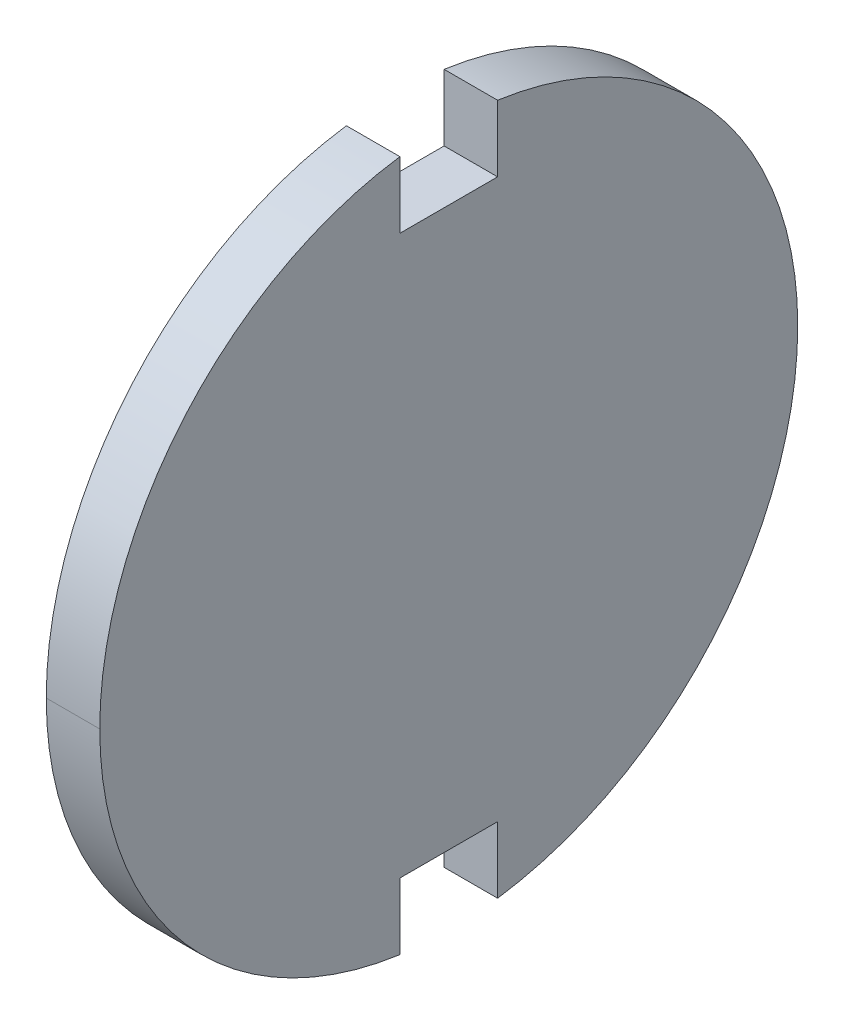
ISO-10303-21;
HEADER;
FILE_DESCRIPTION(('STEP AP214'),'2;1');
FILE_NAME('part.step','',(''),(''),'','','');
FILE_SCHEMA(('AUTOMOTIVE_DESIGN { 1 0 10303 214 1 1 1 1 }'));
ENDSEC;
DATA;
#1=APPLICATION_CONTEXT('core data for automotive mechanical design processes');
#2=APPLICATION_PROTOCOL_DEFINITION('international standard','automotive_design',2000,#1);
#3=PRODUCT_CONTEXT('',#1,'mechanical');
#4=PRODUCT('Part','Part','',(#3));
#5=PRODUCT_RELATED_PRODUCT_CATEGORY('part','',(#4));
#6=PRODUCT_DEFINITION_FORMATION('','',#4);
#7=PRODUCT_DEFINITION_CONTEXT('part definition',#1,'design');
#8=PRODUCT_DEFINITION('design','',#6,#7);
#9=PRODUCT_DEFINITION_SHAPE('','',#8);
#10=(LENGTH_UNIT() NAMED_UNIT(*) SI_UNIT(.MILLI.,.METRE.));
#11=(NAMED_UNIT(*) PLANE_ANGLE_UNIT() SI_UNIT($,.RADIAN.));
#12=(NAMED_UNIT(*) SI_UNIT($,.STERADIAN.) SOLID_ANGLE_UNIT());
#13=UNCERTAINTY_MEASURE_WITH_UNIT(LENGTH_MEASURE(1.E-05),#10,'distance_accuracy_value','');
#14=(GEOMETRIC_REPRESENTATION_CONTEXT(3) GLOBAL_UNCERTAINTY_ASSIGNED_CONTEXT((#13)) GLOBAL_UNIT_ASSIGNED_CONTEXT((#10,
#11,#12)) REPRESENTATION_CONTEXT('',''));
#15=CARTESIAN_POINT('',(0.,0.,0.));
#16=DIRECTION('',(0.,0.,1.));
#17=DIRECTION('',(1.,0.,0.));
#18=AXIS2_PLACEMENT_3D('',#15,#16,#17);
#19=CARTESIAN_POINT('',(158.35,0.,7.5));
#20=DIRECTION('',(1.,0.,0.));
#21=DIRECTION('',(0.,1.,0.));
#22=AXIS2_PLACEMENT_3D('',#19,#20,#21);
#23=PLANE('',#22);
#24=DIRECTION('',(0.,-1.,0.));
#25=VECTOR('',#24,1.);
#26=CARTESIAN_POINT('',(158.35,-8.,-2.1));
#27=LINE('',#26,#25);
#28=CARTESIAN_POINT('',(158.35,-12.,-2.1));
#29=VERTEX_POINT('',#28);
#30=CARTESIAN_POINT('',(158.35,-14.8522725533839,-2.1));
#31=VERTEX_POINT('',#30);
#32=EDGE_CURVE('E184',#29,#31,#27,.T.);
#33=ORIENTED_EDGE('',*,*,#32,.T.);
#34=CARTESIAN_POINT('',(158.35,0.,0.));
#35=DIRECTION('',(1.,0.,0.));
#36=DIRECTION('',(0.,0.,1.));
#37=AXIS2_PLACEMENT_3D('',#34,#35,#36);
#38=CIRCLE('',#37,15.);
#39=CARTESIAN_POINT('',(158.35,0.,-15.));
#40=VERTEX_POINT('',#39);
#41=EDGE_CURVE('E144',#31,#40,#38,.T.);
#42=ORIENTED_EDGE('',*,*,#41,.T.);
#43=CARTESIAN_POINT('',(158.35,0.,0.));
#44=DIRECTION('',(1.,0.,0.));
#45=DIRECTION('',(0.,0.,1.));
#46=AXIS2_PLACEMENT_3D('',#43,#44,#45);
#47=CIRCLE('',#46,15.);
#48=CARTESIAN_POINT('',(158.35,14.8522725533839,-2.1));
#49=VERTEX_POINT('',#48);
#50=EDGE_CURVE('E87',#40,#49,#47,.T.);
#51=ORIENTED_EDGE('',*,*,#50,.T.);
#52=DIRECTION('',(0.,-1.,0.));
#53=VECTOR('',#52,1.);
#54=CARTESIAN_POINT('',(158.35,8.,-2.1));
#55=LINE('',#54,#53);
#56=CARTESIAN_POINT('',(158.35,12.,-2.1));
#57=VERTEX_POINT('',#56);
#58=EDGE_CURVE('E27',#49,#57,#55,.T.);
#59=ORIENTED_EDGE('',*,*,#58,.T.);
#60=DIRECTION('',(0.,0.,1.));
#61=VECTOR('',#60,1.);
#62=CARTESIAN_POINT('',(158.35,12.,3.75));
#63=LINE('',#62,#61);
#64=CARTESIAN_POINT('',(158.35,12.,2.1));
#65=VERTEX_POINT('',#64);
#66=EDGE_CURVE('E11',#57,#65,#63,.T.);
#67=ORIENTED_EDGE('',*,*,#66,.T.);
#68=DIRECTION('',(0.,1.,0.));
#69=VECTOR('',#68,1.);
#70=CARTESIAN_POINT('',(158.35,8.,2.1));
#71=LINE('',#70,#69);
#72=CARTESIAN_POINT('',(158.35,14.8522725533839,2.1));
#73=VERTEX_POINT('',#72);
#74=EDGE_CURVE('E171',#65,#73,#71,.T.);
#75=ORIENTED_EDGE('',*,*,#74,.T.);
#76=CARTESIAN_POINT('',(158.35,0.,0.));
#77=DIRECTION('',(1.,0.,0.));
#78=DIRECTION('',(0.,0.,1.));
#79=AXIS2_PLACEMENT_3D('',#76,#77,#78);
#80=CIRCLE('',#79,15.);
#81=CARTESIAN_POINT('',(158.35,0.,15.));
#82=VERTEX_POINT('',#81);
#83=EDGE_CURVE('E158',#73,#82,#80,.T.);
#84=ORIENTED_EDGE('',*,*,#83,.T.);
#85=CARTESIAN_POINT('',(158.35,0.,0.));
#86=DIRECTION('',(1.,0.,0.));
#87=DIRECTION('',(0.,0.,1.));
#88=AXIS2_PLACEMENT_3D('',#85,#86,#87);
#89=CIRCLE('',#88,15.);
#90=CARTESIAN_POINT('',(158.35,-14.8522725533839,2.1));
#91=VERTEX_POINT('',#90);
#92=EDGE_CURVE('E191',#82,#91,#89,.T.);
#93=ORIENTED_EDGE('',*,*,#92,.T.);
#94=DIRECTION('',(0.,1.,0.));
#95=VECTOR('',#94,1.);
#96=CARTESIAN_POINT('',(158.35,-8.,2.1));
#97=LINE('',#96,#95);
#98=CARTESIAN_POINT('',(158.35,-12.,2.1));
#99=VERTEX_POINT('',#98);
#100=EDGE_CURVE('E222',#91,#99,#97,.T.);
#101=ORIENTED_EDGE('',*,*,#100,.T.);
#102=DIRECTION('',(0.,0.,-1.));
#103=VECTOR('',#102,1.);
#104=CARTESIAN_POINT('',(158.35,-12.,3.75));
#105=LINE('',#104,#103);
#106=EDGE_CURVE('E155',#99,#29,#105,.T.);
#107=ORIENTED_EDGE('',*,*,#106,.T.);
#108=EDGE_LOOP('',(#33,#42,#51,#59,#67,#75,#84,#93,#101,#107));
#109=FACE_BOUND('',#108,.T.);
#110=ADVANCED_FACE('F17',(#109),#23,.T.);
#111=CARTESIAN_POINT('',(157.2,12.,0.));
#112=DIRECTION('',(0.,1.,0.));
#113=DIRECTION('',(1.,0.,0.));
#114=AXIS2_PLACEMENT_3D('',#111,#112,#113);
#115=PLANE('',#114);
#116=DIRECTION('',(0.,0.,-1.));
#117=VECTOR('',#116,1.);
#118=CARTESIAN_POINT('',(156.05,12.,3.75));
#119=LINE('',#118,#117);
#120=CARTESIAN_POINT('',(156.05,12.,2.1));
#121=VERTEX_POINT('',#120);
#122=CARTESIAN_POINT('',(156.05,12.,-2.1));
#123=VERTEX_POINT('',#122);
#124=EDGE_CURVE('E198',#121,#123,#119,.T.);
#125=ORIENTED_EDGE('',*,*,#124,.F.);
#126=DIRECTION('',(1.,0.,0.));
#127=VECTOR('',#126,1.);
#128=CARTESIAN_POINT('',(157.2,12.,2.1));
#129=LINE('',#128,#127);
#130=EDGE_CURVE('E167',#121,#65,#129,.T.);
#131=ORIENTED_EDGE('',*,*,#130,.T.);
#132=ORIENTED_EDGE('',*,*,#66,.F.);
#133=DIRECTION('',(-1.,0.,0.));
#134=VECTOR('',#133,1.);
#135=CARTESIAN_POINT('',(157.2,12.,-2.1));
#136=LINE('',#135,#134);
#137=EDGE_CURVE('E170',#57,#123,#136,.T.);
#138=ORIENTED_EDGE('',*,*,#137,.T.);
#139=EDGE_LOOP('',(#125,#131,#132,#138));
#140=FACE_BOUND('',#139,.T.);
#141=ADVANCED_FACE('F339',(#140),#115,.T.);
#142=CARTESIAN_POINT('',(157.2,16.,-2.1));
#143=DIRECTION('',(0.,0.,1.));
#144=DIRECTION('',(1.,0.,0.));
#145=AXIS2_PLACEMENT_3D('',#142,#143,#144);
#146=PLANE('',#145);
#147=DIRECTION('',(1.,0.,0.));
#148=VECTOR('',#147,1.);
#149=CARTESIAN_POINT('',(157.2,14.8522725533839,-2.1));
#150=LINE('',#149,#148);
#151=CARTESIAN_POINT('',(156.05,14.8522725533839,-2.1));
#152=VERTEX_POINT('',#151);
#153=EDGE_CURVE('E174',#152,#49,#150,.T.);
#154=ORIENTED_EDGE('',*,*,#153,.F.);
#155=DIRECTION('',(0.,1.,0.));
#156=VECTOR('',#155,1.);
#157=CARTESIAN_POINT('',(156.05,8.,-2.1));
#158=LINE('',#157,#156);
#159=EDGE_CURVE('E204',#123,#152,#158,.T.);
#160=ORIENTED_EDGE('',*,*,#159,.F.);
#161=ORIENTED_EDGE('',*,*,#137,.F.);
#162=ORIENTED_EDGE('',*,*,#58,.F.);
#163=EDGE_LOOP('',(#154,#160,#161,#162));
#164=FACE_BOUND('',#163,.T.);
#165=ADVANCED_FACE('F319',(#164),#146,.T.);
#166=CARTESIAN_POINT('',(157.2,16.,2.1));
#167=DIRECTION('',(0.,0.,1.));
#168=DIRECTION('',(1.,0.,0.));
#169=AXIS2_PLACEMENT_3D('',#166,#167,#168);
#170=PLANE('',#169);
#171=DIRECTION('',(-1.,0.,0.));
#172=VECTOR('',#171,1.);
#173=CARTESIAN_POINT('',(157.2,14.8522725533839,2.1));
#174=LINE('',#173,#172);
#175=CARTESIAN_POINT('',(156.05,14.8522725533839,2.1));
#176=VERTEX_POINT('',#175);
#177=EDGE_CURVE('E160',#73,#176,#174,.T.);
#178=ORIENTED_EDGE('',*,*,#177,.F.);
#179=ORIENTED_EDGE('',*,*,#74,.F.);
#180=ORIENTED_EDGE('',*,*,#130,.F.);
#181=DIRECTION('',(0.,-1.,0.));
#182=VECTOR('',#181,1.);
#183=CARTESIAN_POINT('',(156.05,8.,2.1));
#184=LINE('',#183,#182);
#185=EDGE_CURVE('E181',#176,#121,#184,.T.);
#186=ORIENTED_EDGE('',*,*,#185,.F.);
#187=EDGE_LOOP('',(#178,#179,#180,#186));
#188=FACE_BOUND('',#187,.T.);
#189=ADVANCED_FACE('F338',(#188),#170,.F.);
#190=CARTESIAN_POINT('',(156.05,0.,7.5));
#191=DIRECTION('',(-1.,0.,0.));
#192=DIRECTION('',(0.,0.,1.));
#193=AXIS2_PLACEMENT_3D('',#190,#191,#192);
#194=PLANE('',#193);
#195=DIRECTION('',(0.,1.,0.));
#196=VECTOR('',#195,1.);
#197=CARTESIAN_POINT('',(156.05,-8.,-2.1));
#198=LINE('',#197,#196);
#199=CARTESIAN_POINT('',(156.05,-14.8522725533839,-2.1));
#200=VERTEX_POINT('',#199);
#201=CARTESIAN_POINT('',(156.05,-12.,-2.1));
#202=VERTEX_POINT('',#201);
#203=EDGE_CURVE('E126',#200,#202,#198,.T.);
#204=ORIENTED_EDGE('',*,*,#203,.T.);
#205=DIRECTION('',(0.,0.,1.));
#206=VECTOR('',#205,1.);
#207=CARTESIAN_POINT('',(156.05,-12.,3.75));
#208=LINE('',#207,#206);
#209=CARTESIAN_POINT('',(156.05,-12.,2.1));
#210=VERTEX_POINT('',#209);
#211=EDGE_CURVE('E159',#202,#210,#208,.T.);
#212=ORIENTED_EDGE('',*,*,#211,.T.);
#213=DIRECTION('',(0.,-1.,0.));
#214=VECTOR('',#213,1.);
#215=CARTESIAN_POINT('',(156.05,-8.,2.1));
#216=LINE('',#215,#214);
#217=CARTESIAN_POINT('',(156.05,-14.8522725533839,2.1));
#218=VERTEX_POINT('',#217);
#219=EDGE_CURVE('E135',#210,#218,#216,.T.);
#220=ORIENTED_EDGE('',*,*,#219,.T.);
#221=CARTESIAN_POINT('',(156.05,0.,0.));
#222=DIRECTION('',(1.,0.,0.));
#223=DIRECTION('',(0.,0.,1.));
#224=AXIS2_PLACEMENT_3D('',#221,#222,#223);
#225=CIRCLE('',#224,15.);
#226=CARTESIAN_POINT('',(156.05,0.,15.));
#227=VERTEX_POINT('',#226);
#228=EDGE_CURVE('E178',#227,#218,#225,.T.);
#229=ORIENTED_EDGE('',*,*,#228,.F.);
#230=CARTESIAN_POINT('',(156.05,0.,0.));
#231=DIRECTION('',(1.,0.,0.));
#232=DIRECTION('',(0.,0.,1.));
#233=AXIS2_PLACEMENT_3D('',#230,#231,#232);
#234=CIRCLE('',#233,15.);
#235=EDGE_CURVE('E164',#176,#227,#234,.T.);
#236=ORIENTED_EDGE('',*,*,#235,.F.);
#237=ORIENTED_EDGE('',*,*,#185,.T.);
#238=ORIENTED_EDGE('',*,*,#124,.T.);
#239=ORIENTED_EDGE('',*,*,#159,.T.);
#240=CARTESIAN_POINT('',(156.05,0.,0.));
#241=DIRECTION('',(1.,0.,0.));
#242=DIRECTION('',(0.,0.,1.));
#243=AXIS2_PLACEMENT_3D('',#240,#241,#242);
#244=CIRCLE('',#243,15.);
#245=CARTESIAN_POINT('',(156.05,0.,-15.));
#246=VERTEX_POINT('',#245);
#247=EDGE_CURVE('E96',#246,#152,#244,.T.);
#248=ORIENTED_EDGE('',*,*,#247,.F.);
#249=CARTESIAN_POINT('',(156.05,0.,0.));
#250=DIRECTION('',(1.,0.,0.));
#251=DIRECTION('',(0.,0.,1.));
#252=AXIS2_PLACEMENT_3D('',#249,#250,#251);
#253=CIRCLE('',#252,15.);
#254=EDGE_CURVE('E137',#200,#246,#253,.T.);
#255=ORIENTED_EDGE('',*,*,#254,.F.);
#256=EDGE_LOOP('',(#204,#212,#220,#229,#236,#237,#238,#239,#248,#255));
#257=FACE_BOUND('',#256,.T.);
#258=ADVANCED_FACE('F19',(#257),#194,.T.);
#259=CARTESIAN_POINT('',(157.2,0.,0.));
#260=DIRECTION('',(1.,0.,0.));
#261=DIRECTION('',(0.,0.,1.));
#262=AXIS2_PLACEMENT_3D('',#259,#260,#261);
#263=CYLINDRICAL_SURFACE('',#262,15.);
#264=DIRECTION('',(-1.,0.,0.));
#265=VECTOR('',#264,1.);
#266=CARTESIAN_POINT('',(157.2,0.,-15.));
#267=LINE('',#266,#265);
#268=EDGE_CURVE('E151',#40,#246,#267,.T.);
#269=ORIENTED_EDGE('',*,*,#268,.T.);
#270=ORIENTED_EDGE('',*,*,#247,.T.);
#271=ORIENTED_EDGE('',*,*,#153,.T.);
#272=ORIENTED_EDGE('',*,*,#50,.F.);
#273=EDGE_LOOP('',(#269,#270,#271,#272));
#274=FACE_BOUND('',#273,.T.);
#275=ADVANCED_FACE('F316',(#274),#263,.T.);
#276=CARTESIAN_POINT('',(157.2,0.,0.));
#277=DIRECTION('',(1.,0.,0.));
#278=DIRECTION('',(0.,0.,1.));
#279=AXIS2_PLACEMENT_3D('',#276,#277,#278);
#280=CYLINDRICAL_SURFACE('',#279,15.);
#281=DIRECTION('',(1.,0.,0.));
#282=VECTOR('',#281,1.);
#283=CARTESIAN_POINT('',(157.2,0.,15.));
#284=LINE('',#283,#282);
#285=EDGE_CURVE('E141',#227,#82,#284,.T.);
#286=ORIENTED_EDGE('',*,*,#285,.T.);
#287=ORIENTED_EDGE('',*,*,#83,.F.);
#288=ORIENTED_EDGE('',*,*,#177,.T.);
#289=ORIENTED_EDGE('',*,*,#235,.T.);
#290=EDGE_LOOP('',(#286,#287,#288,#289));
#291=FACE_BOUND('',#290,.T.);
#292=ADVANCED_FACE('F335',(#291),#280,.T.);
#293=CARTESIAN_POINT('',(157.2,-12.,0.));
#294=DIRECTION('',(0.,-1.,0.));
#295=DIRECTION('',(0.,0.,-1.));
#296=AXIS2_PLACEMENT_3D('',#293,#294,#295);
#297=PLANE('',#296);
#298=ORIENTED_EDGE('',*,*,#211,.F.);
#299=DIRECTION('',(1.,0.,0.));
#300=VECTOR('',#299,1.);
#301=CARTESIAN_POINT('',(157.2,-12.,-2.1));
#302=LINE('',#301,#300);
#303=EDGE_CURVE('E133',#202,#29,#302,.T.);
#304=ORIENTED_EDGE('',*,*,#303,.T.);
#305=ORIENTED_EDGE('',*,*,#106,.F.);
#306=DIRECTION('',(-1.,0.,0.));
#307=VECTOR('',#306,1.);
#308=CARTESIAN_POINT('',(157.2,-12.,2.1));
#309=LINE('',#308,#307);
#310=EDGE_CURVE('E218',#99,#210,#309,.T.);
#311=ORIENTED_EDGE('',*,*,#310,.T.);
#312=EDGE_LOOP('',(#298,#304,#305,#311));
#313=FACE_BOUND('',#312,.T.);
#314=ADVANCED_FACE('F235',(#313),#297,.T.);
#315=CARTESIAN_POINT('',(157.2,-16.,2.1));
#316=DIRECTION('',(0.,0.,-1.));
#317=DIRECTION('',(0.,-1.,0.));
#318=AXIS2_PLACEMENT_3D('',#315,#316,#317);
#319=PLANE('',#318);
#320=DIRECTION('',(1.,0.,0.));
#321=VECTOR('',#320,1.);
#322=CARTESIAN_POINT('',(157.2,-14.8522725533839,2.1));
#323=LINE('',#322,#321);
#324=EDGE_CURVE('E187',#218,#91,#323,.T.);
#325=ORIENTED_EDGE('',*,*,#324,.F.);
#326=ORIENTED_EDGE('',*,*,#219,.F.);
#327=ORIENTED_EDGE('',*,*,#310,.F.);
#328=ORIENTED_EDGE('',*,*,#100,.F.);
#329=EDGE_LOOP('',(#325,#326,#327,#328));
#330=FACE_BOUND('',#329,.T.);
#331=ADVANCED_FACE('F237',(#330),#319,.T.);
#332=CARTESIAN_POINT('',(157.2,-16.,-2.1));
#333=DIRECTION('',(0.,0.,-1.));
#334=DIRECTION('',(0.,-1.,0.));
#335=AXIS2_PLACEMENT_3D('',#332,#333,#334);
#336=PLANE('',#335);
#337=DIRECTION('',(-1.,0.,0.));
#338=VECTOR('',#337,1.);
#339=CARTESIAN_POINT('',(157.2,-14.8522725533839,-2.1));
#340=LINE('',#339,#338);
#341=EDGE_CURVE('E130',#31,#200,#340,.T.);
#342=ORIENTED_EDGE('',*,*,#341,.F.);
#343=ORIENTED_EDGE('',*,*,#32,.F.);
#344=ORIENTED_EDGE('',*,*,#303,.F.);
#345=ORIENTED_EDGE('',*,*,#203,.F.);
#346=EDGE_LOOP('',(#342,#343,#344,#345));
#347=FACE_BOUND('',#346,.T.);
#348=ADVANCED_FACE('F127',(#347),#336,.F.);
#349=CARTESIAN_POINT('',(157.2,0.,0.));
#350=DIRECTION('',(1.,0.,0.));
#351=DIRECTION('',(0.,0.,1.));
#352=AXIS2_PLACEMENT_3D('',#349,#350,#351);
#353=CYLINDRICAL_SURFACE('',#352,15.);
#354=ORIENTED_EDGE('',*,*,#285,.F.);
#355=ORIENTED_EDGE('',*,*,#228,.T.);
#356=ORIENTED_EDGE('',*,*,#324,.T.);
#357=ORIENTED_EDGE('',*,*,#92,.F.);
#358=EDGE_LOOP('',(#354,#355,#356,#357));
#359=FACE_BOUND('',#358,.T.);
#360=ADVANCED_FACE('F332',(#359),#353,.T.);
#361=CARTESIAN_POINT('',(157.2,0.,0.));
#362=DIRECTION('',(1.,0.,0.));
#363=DIRECTION('',(0.,0.,1.));
#364=AXIS2_PLACEMENT_3D('',#361,#362,#363);
#365=CYLINDRICAL_SURFACE('',#364,15.);
#366=ORIENTED_EDGE('',*,*,#268,.F.);
#367=ORIENTED_EDGE('',*,*,#41,.F.);
#368=ORIENTED_EDGE('',*,*,#341,.T.);
#369=ORIENTED_EDGE('',*,*,#254,.T.);
#370=EDGE_LOOP('',(#366,#367,#368,#369));
#371=FACE_BOUND('',#370,.T.);
#372=ADVANCED_FACE('F143',(#371),#365,.T.);
#373=CLOSED_SHELL('',(#110,#141,#165,#189,#258,#275,#292,#314,#331,#348,#360,#372));
#374=MANIFOLD_SOLID_BREP('B1',#373);
#375=ADVANCED_BREP_SHAPE_REPRESENTATION('',(#18,#374),#14);
#376=SHAPE_DEFINITION_REPRESENTATION(#9,#375);
ENDSEC;
END-ISO-10303-21;
